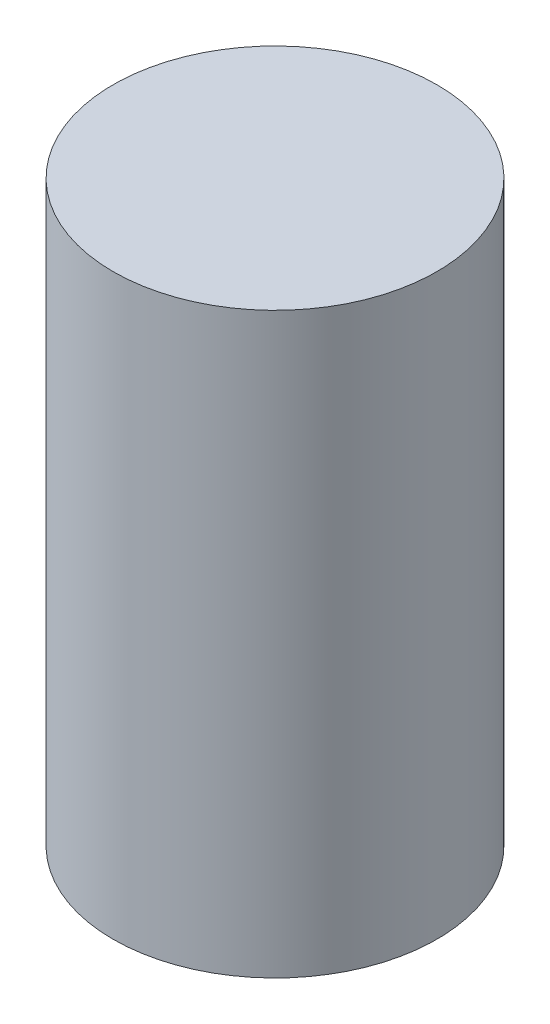
ISO-10303-21;
HEADER;
FILE_DESCRIPTION(('STEP AP214'),'2;1');
FILE_NAME('part.step','',(''),(''),'','','');
FILE_SCHEMA(('AUTOMOTIVE_DESIGN { 1 0 10303 214 1 1 1 1 }'));
ENDSEC;
DATA;
#1=APPLICATION_CONTEXT('core data for automotive mechanical design processes');
#2=APPLICATION_PROTOCOL_DEFINITION('international standard','automotive_design',2000,#1);
#3=PRODUCT_CONTEXT('',#1,'mechanical');
#4=PRODUCT('Part','Part','',(#3));
#5=PRODUCT_RELATED_PRODUCT_CATEGORY('part','',(#4));
#6=PRODUCT_DEFINITION_FORMATION('','',#4);
#7=PRODUCT_DEFINITION_CONTEXT('part definition',#1,'design');
#8=PRODUCT_DEFINITION('design','',#6,#7);
#9=PRODUCT_DEFINITION_SHAPE('','',#8);
#10=(LENGTH_UNIT() NAMED_UNIT(*) SI_UNIT(.MILLI.,.METRE.));
#11=(NAMED_UNIT(*) PLANE_ANGLE_UNIT() SI_UNIT($,.RADIAN.));
#12=(NAMED_UNIT(*) SI_UNIT($,.STERADIAN.) SOLID_ANGLE_UNIT());
#13=UNCERTAINTY_MEASURE_WITH_UNIT(LENGTH_MEASURE(1.E-05),#10,'distance_accuracy_value','');
#14=(GEOMETRIC_REPRESENTATION_CONTEXT(3) GLOBAL_UNCERTAINTY_ASSIGNED_CONTEXT((#13)) GLOBAL_UNIT_ASSIGNED_CONTEXT((#10,
#11,#12)) REPRESENTATION_CONTEXT('',''));
#15=CARTESIAN_POINT('',(0.,0.,0.));
#16=DIRECTION('',(0.,0.,1.));
#17=DIRECTION('',(1.,0.,0.));
#18=AXIS2_PLACEMENT_3D('',#15,#16,#17);
#19=CARTESIAN_POINT('',(0.,255.,44.9999999999999));
#20=DIRECTION('',(0.,1.,0.));
#21=DIRECTION('',(0.,0.,0.999999999999995));
#22=AXIS2_PLACEMENT_3D('',#19,#20,#21);
#23=CYLINDRICAL_SURFACE('',#22,7.);
#24=CARTESIAN_POINT('',(0.,255.,44.9999999999999));
#25=DIRECTION('',(0.,-1.,0.));
#26=DIRECTION('',(0.,0.,-0.999999999999995));
#27=AXIS2_PLACEMENT_3D('',#24,#25,#26);
#28=CIRCLE('',#27,7.);
#29=CARTESIAN_POINT('',(0.,255.,38.));
#30=VERTEX_POINT('',#29);
#31=EDGE_CURVE('E10',#30,#30,#28,.T.);
#32=ORIENTED_EDGE('',*,*,#31,.F.);
#33=EDGE_LOOP('',(#32));
#34=FACE_BOUND('',#33,.T.);
#35=CARTESIAN_POINT('',(-6.66134000063551E-13,280.,44.9999999999997));
#36=DIRECTION('',(0.,-1.,0.));
#37=DIRECTION('',(0.,0.,-0.999999999999995));
#38=AXIS2_PLACEMENT_3D('',#35,#36,#37);
#39=CIRCLE('',#38,7.);
#40=CARTESIAN_POINT('',(-6.62636797535982E-13,280.,37.9999999999997));
#41=VERTEX_POINT('',#40);
#42=EDGE_CURVE('E40',#41,#41,#39,.T.);
#43=ORIENTED_EDGE('',*,*,#42,.T.);
#44=EDGE_LOOP('',(#43));
#45=FACE_BOUND('',#44,.T.);
#46=ADVANCED_FACE('F37',(#34,#45),#23,.T.);
#47=CARTESIAN_POINT('',(0.,255.,44.9999999999999));
#48=DIRECTION('',(0.,-1.,0.));
#49=DIRECTION('',(0.,0.,-0.999999999999995));
#50=AXIS2_PLACEMENT_3D('',#47,#48,#49);
#51=PLANE('',#50);
#52=ORIENTED_EDGE('',*,*,#31,.T.);
#53=EDGE_LOOP('',(#52));
#54=FACE_BOUND('',#53,.T.);
#55=ADVANCED_FACE('F56',(#54),#51,.T.);
#56=CARTESIAN_POINT('',(-6.66134000063551E-13,280.,44.9999999999997));
#57=DIRECTION('',(0.,-1.,0.));
#58=DIRECTION('',(0.,0.,-0.999999999999995));
#59=AXIS2_PLACEMENT_3D('',#56,#57,#58);
#60=PLANE('',#59);
#61=ORIENTED_EDGE('',*,*,#42,.F.);
#62=EDGE_LOOP('',(#61));
#63=FACE_BOUND('',#62,.T.);
#64=ADVANCED_FACE('F54',(#63),#60,.F.);
#65=CLOSED_SHELL('',(#46,#55,#64));
#66=MANIFOLD_SOLID_BREP('B2',#65);
#67=ADVANCED_BREP_SHAPE_REPRESENTATION('',(#18,#66),#14);
#68=SHAPE_DEFINITION_REPRESENTATION(#9,#67);
ENDSEC;
END-ISO-10303-21;
